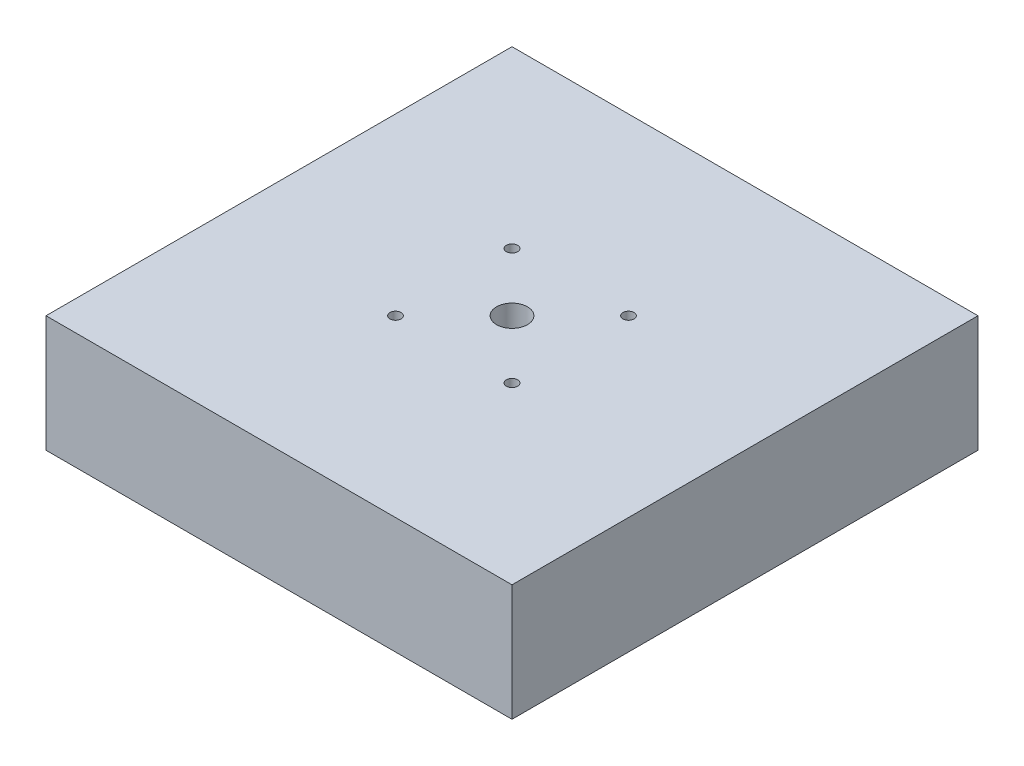
ISO-10303-21;
HEADER;
FILE_DESCRIPTION(('STEP AP214'),'2;1');
FILE_NAME('part.step','',(''),(''),'','','');
FILE_SCHEMA(('AUTOMOTIVE_DESIGN { 1 0 10303 214 1 1 1 1 }'));
ENDSEC;
DATA;
#1=APPLICATION_CONTEXT('core data for automotive mechanical design processes');
#2=APPLICATION_PROTOCOL_DEFINITION('international standard','automotive_design',2000,#1);
#3=PRODUCT_CONTEXT('',#1,'mechanical');
#4=PRODUCT('Part','Part','',(#3));
#5=PRODUCT_RELATED_PRODUCT_CATEGORY('part','',(#4));
#6=PRODUCT_DEFINITION_FORMATION('','',#4);
#7=PRODUCT_DEFINITION_CONTEXT('part definition',#1,'design');
#8=PRODUCT_DEFINITION('design','',#6,#7);
#9=PRODUCT_DEFINITION_SHAPE('','',#8);
#10=(LENGTH_UNIT() NAMED_UNIT(*) SI_UNIT(.MILLI.,.METRE.));
#11=(NAMED_UNIT(*) PLANE_ANGLE_UNIT() SI_UNIT($,.RADIAN.));
#12=(NAMED_UNIT(*) SI_UNIT($,.STERADIAN.) SOLID_ANGLE_UNIT());
#13=UNCERTAINTY_MEASURE_WITH_UNIT(LENGTH_MEASURE(1.E-05),#10,'distance_accuracy_value','');
#14=(GEOMETRIC_REPRESENTATION_CONTEXT(3) GLOBAL_UNCERTAINTY_ASSIGNED_CONTEXT((#13)) GLOBAL_UNIT_ASSIGNED_CONTEXT((#10,
#11,#12)) REPRESENTATION_CONTEXT('',''));
#15=CARTESIAN_POINT('',(0.,0.,0.));
#16=DIRECTION('',(0.,0.,1.));
#17=DIRECTION('',(1.,0.,0.));
#18=AXIS2_PLACEMENT_3D('',#15,#16,#17);
#19=CARTESIAN_POINT('',(-50.8,25.4,-50.8));
#20=DIRECTION('',(1.,0.,0.));
#21=DIRECTION('',(0.,0.,-1.));
#22=AXIS2_PLACEMENT_3D('',#19,#20,#21);
#23=PLANE('',#22);
#24=DIRECTION('',(0.,0.,1.));
#25=VECTOR('',#24,1.);
#26=CARTESIAN_POINT('',(-50.8,0.,-50.8));
#27=LINE('',#26,#25);
#28=CARTESIAN_POINT('',(-50.8,0.,-50.8));
#29=VERTEX_POINT('',#28);
#30=CARTESIAN_POINT('',(-50.8,0.,50.8));
#31=VERTEX_POINT('',#30);
#32=EDGE_CURVE('E96',#29,#31,#27,.T.);
#33=ORIENTED_EDGE('',*,*,#32,.T.);
#34=DIRECTION('',(0.,-1.,0.));
#35=VECTOR('',#34,1.);
#36=CARTESIAN_POINT('',(-50.8,25.4,50.8));
#37=LINE('',#36,#35);
#38=CARTESIAN_POINT('',(-50.8,25.4,50.8));
#39=VERTEX_POINT('',#38);
#40=EDGE_CURVE('E11',#39,#31,#37,.T.);
#41=ORIENTED_EDGE('',*,*,#40,.F.);
#42=DIRECTION('',(0.,0.,1.));
#43=VECTOR('',#42,1.);
#44=CARTESIAN_POINT('',(-50.8,25.4,-50.8));
#45=LINE('',#44,#43);
#46=CARTESIAN_POINT('',(-50.8,25.4,-50.8));
#47=VERTEX_POINT('',#46);
#48=EDGE_CURVE('E84',#47,#39,#45,.T.);
#49=ORIENTED_EDGE('',*,*,#48,.F.);
#50=DIRECTION('',(0.,-1.,0.));
#51=VECTOR('',#50,1.);
#52=CARTESIAN_POINT('',(-50.8,25.4,-50.8));
#53=LINE('',#52,#51);
#54=EDGE_CURVE('E92',#47,#29,#53,.T.);
#55=ORIENTED_EDGE('',*,*,#54,.T.);
#56=EDGE_LOOP('',(#33,#41,#49,#55));
#57=FACE_BOUND('',#56,.T.);
#58=ADVANCED_FACE('F33',(#57),#23,.F.);
#59=CARTESIAN_POINT('',(50.8,25.4,50.8));
#60=DIRECTION('',(0.,0.,-1.));
#61=DIRECTION('',(-1.,0.,0.));
#62=AXIS2_PLACEMENT_3D('',#59,#60,#61);
#63=PLANE('',#62);
#64=DIRECTION('',(1.,0.,0.));
#65=VECTOR('',#64,1.);
#66=CARTESIAN_POINT('',(50.8,0.,50.8));
#67=LINE('',#66,#65);
#68=CARTESIAN_POINT('',(50.8,0.,50.8));
#69=VERTEX_POINT('',#68);
#70=EDGE_CURVE('E88',#31,#69,#67,.T.);
#71=ORIENTED_EDGE('',*,*,#70,.T.);
#72=DIRECTION('',(0.,-1.,0.));
#73=VECTOR('',#72,1.);
#74=CARTESIAN_POINT('',(50.8,25.4,50.8));
#75=LINE('',#74,#73);
#76=CARTESIAN_POINT('',(50.8,25.4,50.8));
#77=VERTEX_POINT('',#76);
#78=EDGE_CURVE('E41',#77,#69,#75,.T.);
#79=ORIENTED_EDGE('',*,*,#78,.F.);
#80=DIRECTION('',(1.,0.,0.));
#81=VECTOR('',#80,1.);
#82=CARTESIAN_POINT('',(50.8,25.4,50.8));
#83=LINE('',#82,#81);
#84=EDGE_CURVE('E79',#39,#77,#83,.T.);
#85=ORIENTED_EDGE('',*,*,#84,.F.);
#86=ORIENTED_EDGE('',*,*,#40,.T.);
#87=EDGE_LOOP('',(#71,#79,#85,#86));
#88=FACE_BOUND('',#87,.T.);
#89=ADVANCED_FACE('F87',(#88),#63,.F.);
#90=CARTESIAN_POINT('',(50.8,25.4,-50.8));
#91=DIRECTION('',(-1.,0.,0.));
#92=DIRECTION('',(0.,0.,1.));
#93=AXIS2_PLACEMENT_3D('',#90,#91,#92);
#94=PLANE('',#93);
#95=DIRECTION('',(0.,0.,-1.));
#96=VECTOR('',#95,1.);
#97=CARTESIAN_POINT('',(50.8,0.,-50.8));
#98=LINE('',#97,#96);
#99=CARTESIAN_POINT('',(50.8,0.,-50.8));
#100=VERTEX_POINT('',#99);
#101=EDGE_CURVE('E66',#69,#100,#98,.T.);
#102=ORIENTED_EDGE('',*,*,#101,.T.);
#103=DIRECTION('',(0.,-1.,0.));
#104=VECTOR('',#103,1.);
#105=CARTESIAN_POINT('',(50.8,25.4,-50.8));
#106=LINE('',#105,#104);
#107=CARTESIAN_POINT('',(50.8,25.4,-50.8));
#108=VERTEX_POINT('',#107);
#109=EDGE_CURVE('E89',#108,#100,#106,.T.);
#110=ORIENTED_EDGE('',*,*,#109,.F.);
#111=DIRECTION('',(0.,0.,-1.));
#112=VECTOR('',#111,1.);
#113=CARTESIAN_POINT('',(50.8,25.4,-50.8));
#114=LINE('',#113,#112);
#115=EDGE_CURVE('E82',#77,#108,#114,.T.);
#116=ORIENTED_EDGE('',*,*,#115,.F.);
#117=ORIENTED_EDGE('',*,*,#78,.T.);
#118=EDGE_LOOP('',(#102,#110,#116,#117));
#119=FACE_BOUND('',#118,.T.);
#120=ADVANCED_FACE('F90',(#119),#94,.F.);
#121=CARTESIAN_POINT('',(50.8,25.4,-50.8));
#122=DIRECTION('',(0.,0.,1.));
#123=DIRECTION('',(1.,0.,0.));
#124=AXIS2_PLACEMENT_3D('',#121,#122,#123);
#125=PLANE('',#124);
#126=DIRECTION('',(-1.,0.,0.));
#127=VECTOR('',#126,1.);
#128=CARTESIAN_POINT('',(50.8,0.,-50.8));
#129=LINE('',#128,#127);
#130=EDGE_CURVE('E72',#100,#29,#129,.T.);
#131=ORIENTED_EDGE('',*,*,#130,.T.);
#132=ORIENTED_EDGE('',*,*,#54,.F.);
#133=DIRECTION('',(-1.,0.,0.));
#134=VECTOR('',#133,1.);
#135=CARTESIAN_POINT('',(50.8,25.4,-50.8));
#136=LINE('',#135,#134);
#137=EDGE_CURVE('E49',#108,#47,#136,.T.);
#138=ORIENTED_EDGE('',*,*,#137,.F.);
#139=ORIENTED_EDGE('',*,*,#109,.T.);
#140=EDGE_LOOP('',(#131,#132,#138,#139));
#141=FACE_BOUND('',#140,.T.);
#142=ADVANCED_FACE('F104',(#141),#125,.F.);
#143=CARTESIAN_POINT('',(0.,25.4,0.));
#144=DIRECTION('',(0.,-1.,0.));
#145=DIRECTION('',(0.,0.,-1.));
#146=AXIS2_PLACEMENT_3D('',#143,#144,#145);
#147=PLANE('',#146);
#148=CARTESIAN_POINT('',(12.7,25.4,-12.7));
#149=DIRECTION('',(0.,1.,0.));
#150=DIRECTION('',(0.,0.,1.));
#151=AXIS2_PLACEMENT_3D('',#148,#149,#150);
#152=CIRCLE('',#151,1.21919999999999);
#153=CARTESIAN_POINT('',(12.7,25.4,-11.4808));
#154=VERTEX_POINT('',#153);
#155=EDGE_CURVE('E136',#154,#154,#152,.T.);
#156=ORIENTED_EDGE('',*,*,#155,.F.);
#157=EDGE_LOOP('',(#156));
#158=FACE_BOUND('',#157,.T.);
#159=CARTESIAN_POINT('',(-12.7,25.4,12.7));
#160=DIRECTION('',(0.,1.,0.));
#161=DIRECTION('',(0.,0.,1.));
#162=AXIS2_PLACEMENT_3D('',#159,#160,#161);
#163=CIRCLE('',#162,1.21919999999999);
#164=CARTESIAN_POINT('',(-12.7,25.4,13.9192));
#165=VERTEX_POINT('',#164);
#166=EDGE_CURVE('E130',#165,#165,#163,.T.);
#167=ORIENTED_EDGE('',*,*,#166,.F.);
#168=EDGE_LOOP('',(#167));
#169=FACE_BOUND('',#168,.T.);
#170=CARTESIAN_POINT('',(12.7,25.4,12.7));
#171=DIRECTION('',(0.,1.,0.));
#172=DIRECTION('',(0.,0.,1.));
#173=AXIS2_PLACEMENT_3D('',#170,#171,#172);
#174=CIRCLE('',#173,1.21919999999999);
#175=CARTESIAN_POINT('',(12.7,25.4,13.9192));
#176=VERTEX_POINT('',#175);
#177=EDGE_CURVE('E124',#176,#176,#174,.T.);
#178=ORIENTED_EDGE('',*,*,#177,.F.);
#179=EDGE_LOOP('',(#178));
#180=FACE_BOUND('',#179,.T.);
#181=CARTESIAN_POINT('',(-12.7,25.4,-12.7));
#182=DIRECTION('',(0.,1.,0.));
#183=DIRECTION('',(0.,0.,1.));
#184=AXIS2_PLACEMENT_3D('',#181,#182,#183);
#185=CIRCLE('',#184,1.21919999999999);
#186=CARTESIAN_POINT('',(-12.7,25.4,-11.4808));
#187=VERTEX_POINT('',#186);
#188=EDGE_CURVE('E118',#187,#187,#185,.T.);
#189=ORIENTED_EDGE('',*,*,#188,.F.);
#190=EDGE_LOOP('',(#189));
#191=FACE_BOUND('',#190,.T.);
#192=CARTESIAN_POINT('',(0.,25.4,0.));
#193=DIRECTION('',(0.,1.,0.));
#194=DIRECTION('',(0.,0.,1.));
#195=AXIS2_PLACEMENT_3D('',#192,#193,#194);
#196=CIRCLE('',#195,3.37819999999999);
#197=CARTESIAN_POINT('',(0.,25.4,3.37819999999999));
#198=VERTEX_POINT('',#197);
#199=EDGE_CURVE('E112',#198,#198,#196,.T.);
#200=ORIENTED_EDGE('',*,*,#199,.F.);
#201=EDGE_LOOP('',(#200));
#202=FACE_BOUND('',#201,.T.);
#203=ORIENTED_EDGE('',*,*,#48,.T.);
#204=ORIENTED_EDGE('',*,*,#84,.T.);
#205=ORIENTED_EDGE('',*,*,#115,.T.);
#206=ORIENTED_EDGE('',*,*,#137,.T.);
#207=EDGE_LOOP('',(#203,#204,#205,#206));
#208=FACE_BOUND('',#207,.T.);
#209=ADVANCED_FACE('F80',(#158,#169,#180,#191,#202,#208),#147,.F.);
#210=CARTESIAN_POINT('',(0.,0.,0.));
#211=DIRECTION('',(0.,-1.,0.));
#212=DIRECTION('',(0.,0.,-1.));
#213=AXIS2_PLACEMENT_3D('',#210,#211,#212);
#214=PLANE('',#213);
#215=CARTESIAN_POINT('',(12.7,0.,-12.7));
#216=DIRECTION('',(0.,1.,0.));
#217=DIRECTION('',(0.,0.,1.));
#218=AXIS2_PLACEMENT_3D('',#215,#216,#217);
#219=CIRCLE('',#218,1.21919999999998);
#220=CARTESIAN_POINT('',(12.7,0.,-11.4808));
#221=VERTEX_POINT('',#220);
#222=EDGE_CURVE('E133',#221,#221,#219,.T.);
#223=ORIENTED_EDGE('',*,*,#222,.T.);
#224=EDGE_LOOP('',(#223));
#225=FACE_BOUND('',#224,.T.);
#226=CARTESIAN_POINT('',(-12.7,0.,12.7));
#227=DIRECTION('',(0.,1.,0.));
#228=DIRECTION('',(0.,0.,1.));
#229=AXIS2_PLACEMENT_3D('',#226,#227,#228);
#230=CIRCLE('',#229,1.21919999999998);
#231=CARTESIAN_POINT('',(-12.7,0.,13.9192));
#232=VERTEX_POINT('',#231);
#233=EDGE_CURVE('E127',#232,#232,#230,.T.);
#234=ORIENTED_EDGE('',*,*,#233,.T.);
#235=EDGE_LOOP('',(#234));
#236=FACE_BOUND('',#235,.T.);
#237=CARTESIAN_POINT('',(12.7,0.,12.7));
#238=DIRECTION('',(0.,1.,0.));
#239=DIRECTION('',(0.,0.,1.));
#240=AXIS2_PLACEMENT_3D('',#237,#238,#239);
#241=CIRCLE('',#240,1.21919999999998);
#242=CARTESIAN_POINT('',(12.7,0.,13.9192));
#243=VERTEX_POINT('',#242);
#244=EDGE_CURVE('E121',#243,#243,#241,.T.);
#245=ORIENTED_EDGE('',*,*,#244,.T.);
#246=EDGE_LOOP('',(#245));
#247=FACE_BOUND('',#246,.T.);
#248=CARTESIAN_POINT('',(-12.7,0.,-12.7));
#249=DIRECTION('',(0.,1.,0.));
#250=DIRECTION('',(0.,0.,1.));
#251=AXIS2_PLACEMENT_3D('',#248,#249,#250);
#252=CIRCLE('',#251,1.21919999999998);
#253=CARTESIAN_POINT('',(-12.7,0.,-11.4808));
#254=VERTEX_POINT('',#253);
#255=EDGE_CURVE('E115',#254,#254,#252,.T.);
#256=ORIENTED_EDGE('',*,*,#255,.T.);
#257=EDGE_LOOP('',(#256));
#258=FACE_BOUND('',#257,.T.);
#259=CARTESIAN_POINT('',(0.,0.,0.));
#260=DIRECTION('',(0.,1.,0.));
#261=DIRECTION('',(0.,0.,1.));
#262=AXIS2_PLACEMENT_3D('',#259,#260,#261);
#263=CIRCLE('',#262,3.37819999999998);
#264=CARTESIAN_POINT('',(0.,0.,3.37819999999998));
#265=VERTEX_POINT('',#264);
#266=EDGE_CURVE('E99',#265,#265,#263,.T.);
#267=ORIENTED_EDGE('',*,*,#266,.T.);
#268=EDGE_LOOP('',(#267));
#269=FACE_BOUND('',#268,.T.);
#270=ORIENTED_EDGE('',*,*,#32,.F.);
#271=ORIENTED_EDGE('',*,*,#130,.F.);
#272=ORIENTED_EDGE('',*,*,#101,.F.);
#273=ORIENTED_EDGE('',*,*,#70,.F.);
#274=EDGE_LOOP('',(#270,#271,#272,#273));
#275=FACE_BOUND('',#274,.T.);
#276=ADVANCED_FACE('F107',(#225,#236,#247,#258,#269,#275),#214,.T.);
#277=CARTESIAN_POINT('',(0.,25.4,0.));
#278=DIRECTION('',(0.,1.,0.));
#279=DIRECTION('',(0.,0.,1.));
#280=AXIS2_PLACEMENT_3D('',#277,#278,#279);
#281=CYLINDRICAL_SURFACE('',#280,3.37819999999999);
#282=ORIENTED_EDGE('',*,*,#266,.F.);
#283=EDGE_LOOP('',(#282));
#284=FACE_BOUND('',#283,.T.);
#285=ORIENTED_EDGE('',*,*,#199,.T.);
#286=EDGE_LOOP('',(#285));
#287=FACE_BOUND('',#286,.T.);
#288=ADVANCED_FACE('F153',(#284,#287),#281,.F.);
#289=CARTESIAN_POINT('',(-12.7,25.4,-12.7));
#290=DIRECTION('',(0.,1.,0.));
#291=DIRECTION('',(0.,0.,1.));
#292=AXIS2_PLACEMENT_3D('',#289,#290,#291);
#293=CYLINDRICAL_SURFACE('',#292,1.21919999999999);
#294=ORIENTED_EDGE('',*,*,#255,.F.);
#295=EDGE_LOOP('',(#294));
#296=FACE_BOUND('',#295,.T.);
#297=ORIENTED_EDGE('',*,*,#188,.T.);
#298=EDGE_LOOP('',(#297));
#299=FACE_BOUND('',#298,.T.);
#300=ADVANCED_FACE('F155',(#296,#299),#293,.F.);
#301=CARTESIAN_POINT('',(12.7,25.4,12.7));
#302=DIRECTION('',(0.,1.,0.));
#303=DIRECTION('',(0.,0.,1.));
#304=AXIS2_PLACEMENT_3D('',#301,#302,#303);
#305=CYLINDRICAL_SURFACE('',#304,1.21919999999999);
#306=ORIENTED_EDGE('',*,*,#244,.F.);
#307=EDGE_LOOP('',(#306));
#308=FACE_BOUND('',#307,.T.);
#309=ORIENTED_EDGE('',*,*,#177,.T.);
#310=EDGE_LOOP('',(#309));
#311=FACE_BOUND('',#310,.T.);
#312=ADVANCED_FACE('F162',(#308,#311),#305,.F.);
#313=CARTESIAN_POINT('',(-12.7,25.4,12.7));
#314=DIRECTION('',(0.,1.,0.));
#315=DIRECTION('',(0.,0.,1.));
#316=AXIS2_PLACEMENT_3D('',#313,#314,#315);
#317=CYLINDRICAL_SURFACE('',#316,1.21919999999999);
#318=ORIENTED_EDGE('',*,*,#233,.F.);
#319=EDGE_LOOP('',(#318));
#320=FACE_BOUND('',#319,.T.);
#321=ORIENTED_EDGE('',*,*,#166,.T.);
#322=EDGE_LOOP('',(#321));
#323=FACE_BOUND('',#322,.T.);
#324=ADVANCED_FACE('F201',(#320,#323),#317,.F.);
#325=CARTESIAN_POINT('',(12.7,25.4,-12.7));
#326=DIRECTION('',(0.,1.,0.));
#327=DIRECTION('',(0.,0.,1.));
#328=AXIS2_PLACEMENT_3D('',#325,#326,#327);
#329=CYLINDRICAL_SURFACE('',#328,1.21919999999999);
#330=ORIENTED_EDGE('',*,*,#222,.F.);
#331=EDGE_LOOP('',(#330));
#332=FACE_BOUND('',#331,.T.);
#333=ORIENTED_EDGE('',*,*,#155,.T.);
#334=EDGE_LOOP('',(#333));
#335=FACE_BOUND('',#334,.T.);
#336=ADVANCED_FACE('F140',(#332,#335),#329,.F.);
#337=CLOSED_SHELL('',(#58,#89,#120,#142,#209,#276,#288,#300,#312,#324,#336));
#338=MANIFOLD_SOLID_BREP('B2',#337);
#339=ADVANCED_BREP_SHAPE_REPRESENTATION('',(#18,#338),#14);
#340=SHAPE_DEFINITION_REPRESENTATION(#9,#339);
ENDSEC;
END-ISO-10303-21;
